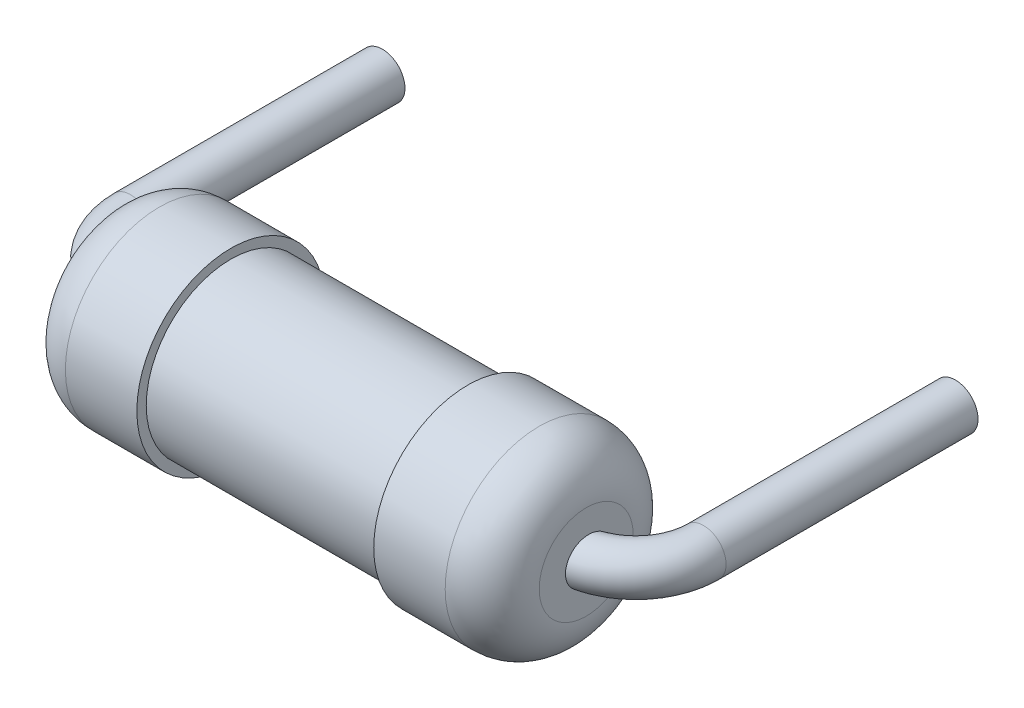
ISO-10303-21;
HEADER;
FILE_DESCRIPTION(('STEP AP214'),'2;1');
FILE_NAME('part.step','',(''),(''),'','','');
FILE_SCHEMA(('AUTOMOTIVE_DESIGN { 1 0 10303 214 1 1 1 1 }'));
ENDSEC;
DATA;
#1=APPLICATION_CONTEXT('core data for automotive mechanical design processes');
#2=APPLICATION_PROTOCOL_DEFINITION('international standard','automotive_design',2000,#1);
#3=PRODUCT_CONTEXT('',#1,'mechanical');
#4=PRODUCT('Part','Part','',(#3));
#5=PRODUCT_RELATED_PRODUCT_CATEGORY('part','',(#4));
#6=PRODUCT_DEFINITION_FORMATION('','',#4);
#7=PRODUCT_DEFINITION_CONTEXT('part definition',#1,'design');
#8=PRODUCT_DEFINITION('design','',#6,#7);
#9=PRODUCT_DEFINITION_SHAPE('','',#8);
#10=(LENGTH_UNIT() NAMED_UNIT(*) SI_UNIT(.MILLI.,.METRE.));
#11=(NAMED_UNIT(*) PLANE_ANGLE_UNIT() SI_UNIT($,.RADIAN.));
#12=(NAMED_UNIT(*) SI_UNIT($,.STERADIAN.) SOLID_ANGLE_UNIT());
#13=UNCERTAINTY_MEASURE_WITH_UNIT(LENGTH_MEASURE(1.E-05),#10,'distance_accuracy_value','');
#14=(GEOMETRIC_REPRESENTATION_CONTEXT(3) GLOBAL_UNCERTAINTY_ASSIGNED_CONTEXT((#13)) GLOBAL_UNIT_ASSIGNED_CONTEXT((#10,
#11,#12)) REPRESENTATION_CONTEXT('',''));
#15=CARTESIAN_POINT('',(0.,0.,0.));
#16=DIRECTION('',(0.,0.,1.));
#17=DIRECTION('',(1.,0.,0.));
#18=AXIS2_PLACEMENT_3D('',#15,#16,#17);
#19=CARTESIAN_POINT('',(7.32,-0.30606,-3.));
#20=DIRECTION('',(0.,0.,1.));
#21=DIRECTION('',(1.,0.,0.));
#22=AXIS2_PLACEMENT_3D('',#19,#20,#21);
#23=PLANE('',#22);
#24=CARTESIAN_POINT('',(7.61999999999981,0.,-3.));
#25=DIRECTION('',(0.,0.,-1.));
#26=DIRECTION('',(-1.,0.,0.));
#27=AXIS2_PLACEMENT_3D('',#24,#25,#26);
#28=CIRCLE('',#27,0.29999999999984);
#29=CARTESIAN_POINT('',(7.31999999999997,0.,-3.));
#30=VERTEX_POINT('',#29);
#31=EDGE_CURVE('E19',#30,#30,#28,.F.);
#32=ORIENTED_EDGE('',*,*,#31,.F.);
#33=EDGE_LOOP('',(#32));
#34=FACE_BOUND('',#33,.T.);
#35=ADVANCED_FACE('F15',(#34),#23,.F.);
#36=CARTESIAN_POINT('',(0.3,-0.30606,-3.));
#37=DIRECTION('',(0.,0.,-1.));
#38=DIRECTION('',(-1.,0.,0.));
#39=AXIS2_PLACEMENT_3D('',#36,#37,#38);
#40=PLANE('',#39);
#41=CARTESIAN_POINT('',(1.94411002053807E-13,0.,-3.));
#42=DIRECTION('',(0.,0.,1.));
#43=DIRECTION('',(1.,0.,0.));
#44=AXIS2_PLACEMENT_3D('',#41,#42,#43);
#45=CIRCLE('',#44,0.29999999999984);
#46=CARTESIAN_POINT('',(0.300000000000034,0.,-3.));
#47=VERTEX_POINT('',#46);
#48=EDGE_CURVE('E108',#47,#47,#45,.T.);
#49=ORIENTED_EDGE('',*,*,#48,.F.);
#50=EDGE_LOOP('',(#49));
#51=FACE_BOUND('',#50,.T.);
#52=ADVANCED_FACE('F121',(#51),#40,.T.);
#53=CARTESIAN_POINT('',(7.61999999999981,0.,0.35));
#54=DIRECTION('',(0.,0.,-1.));
#55=DIRECTION('',(-1.,0.,0.));
#56=AXIS2_PLACEMENT_3D('',#53,#54,#55);
#57=CYLINDRICAL_SURFACE('',#56,0.29999999999984);
#58=ORIENTED_EDGE('',*,*,#31,.T.);
#59=EDGE_LOOP('',(#58));
#60=FACE_BOUND('',#59,.T.);
#61=CARTESIAN_POINT('',(7.61999999999981,0.,0.35));
#62=DIRECTION('',(0.,0.,1.));
#63=DIRECTION('',(1.,0.,0.));
#64=AXIS2_PLACEMENT_3D('',#61,#62,#63);
#65=CIRCLE('',#64,0.29999999999984);
#66=CARTESIAN_POINT('',(7.91999999999965,0.,0.35));
#67=VERTEX_POINT('',#66);
#68=EDGE_CURVE('E31',#67,#67,#65,.T.);
#69=ORIENTED_EDGE('',*,*,#68,.F.);
#70=EDGE_LOOP('',(#69));
#71=FACE_BOUND('',#70,.T.);
#72=ADVANCED_FACE('F117',(#60,#71),#57,.T.);
#73=CARTESIAN_POINT('',(1.94411002053807E-13,0.,-3.));
#74=DIRECTION('',(0.,0.,1.));
#75=DIRECTION('',(1.,0.,0.));
#76=AXIS2_PLACEMENT_3D('',#73,#74,#75);
#77=CYLINDRICAL_SURFACE('',#76,0.29999999999984);
#78=CARTESIAN_POINT('',(1.94749815232709E-13,0.,0.35));
#79=DIRECTION('',(0.,0.,1.));
#80=DIRECTION('',(1.,0.,0.));
#81=AXIS2_PLACEMENT_3D('',#78,#79,#80);
#82=CIRCLE('',#81,0.29999999999984);
#83=CARTESIAN_POINT('',(0.300000000000035,0.,0.35));
#84=VERTEX_POINT('',#83);
#85=EDGE_CURVE('E102',#84,#84,#82,.T.);
#86=ORIENTED_EDGE('',*,*,#85,.F.);
#87=EDGE_LOOP('',(#86));
#88=FACE_BOUND('',#87,.T.);
#89=ORIENTED_EDGE('',*,*,#48,.T.);
#90=EDGE_LOOP('',(#89));
#91=FACE_BOUND('',#90,.T.);
#92=ADVANCED_FACE('F131',(#88,#91),#77,.T.);
#93=CARTESIAN_POINT('',(6.71999999999944,0.,0.35));
#94=DIRECTION('',(0.,1.,0.));
#95=DIRECTION('',(-1.,0.,0.));
#96=AXIS2_PLACEMENT_3D('',#93,#94,#95);
#97=TOROIDAL_SURFACE('',#96,0.899999999999278,0.299999999999489);
#98=ORIENTED_EDGE('',*,*,#68,.T.);
#99=EDGE_LOOP('',(#98));
#100=FACE_BOUND('',#99,.T.);
#101=CARTESIAN_POINT('',(6.96,0.,0.899909083394227));
#102=CARTESIAN_POINT('',(6.96,0.0159516554723529,0.899910187994072));
#103=CARTESIAN_POINT('',(6.96,0.0319162433137313,0.901305025316858));
#104=CARTESIAN_POINT('',(6.96,0.0633800309051226,0.906818061157604));
#105=CARTESIAN_POINT('',(6.96,0.0788785689724196,0.910939956734047));
#106=CARTESIAN_POINT('',(6.96,0.108924283208002,0.921697106341317));
#107=CARTESIAN_POINT('',(6.96,0.123474005167887,0.928325280422508));
#108=CARTESIAN_POINT('',(6.96,0.151316689300573,0.943824914688805));
#109=CARTESIAN_POINT('',(6.96,0.164609686434443,0.952696312443997));
#110=CARTESIAN_POINT('',(6.96,0.190219770658707,0.97281979688568));
#111=CARTESIAN_POINT('',(6.96,0.202467582678886,0.984159904646155));
#112=CARTESIAN_POINT('',(6.96,0.225042694189264,1.00861260964609));
#113=CARTESIAN_POINT('',(6.96,0.235369406577394,1.02172574662893));
#114=CARTESIAN_POINT('',(6.96,0.254552398792096,1.05035890713556));
#115=CARTESIAN_POINT('',(6.96,0.263252705808074,1.06598362592229));
#116=CARTESIAN_POINT('',(6.96,0.278005987297219,1.09843802639794));
#117=CARTESIAN_POINT('',(6.96,0.284058377101174,1.1152679732517));
#118=CARTESIAN_POINT('',(6.96,0.293506458879565,1.15025944165083));
#119=CARTESIAN_POINT('',(6.96,0.296807665208281,1.16844659340842));
#120=CARTESIAN_POINT('',(6.96,0.300288414073635,1.20511863148377));
#121=CARTESIAN_POINT('',(6.96,0.300467973664391,1.22360351617441));
#122=CARTESIAN_POINT('',(6.96,0.297667687344931,1.26020668826948));
#123=CARTESIAN_POINT('',(6.96,0.294709573725768,1.27832662303737));
#124=CARTESIAN_POINT('',(6.96,0.285705916224718,1.31378382692248));
#125=CARTESIAN_POINT('',(6.96,0.279660785552893,1.33112120045082));
#126=CARTESIAN_POINT('',(6.96,0.264826971263629,1.36400855368817));
#127=CARTESIAN_POINT('',(6.96,0.256118109397808,1.37959452169983));
#128=CARTESIAN_POINT('',(6.96,0.236129979694342,1.40902140844184));
#129=CARTESIAN_POINT('',(6.96,0.224851149510255,1.42286262367277));
#130=CARTESIAN_POINT('',(6.96,0.200412641652212,1.4479656297997));
#131=CARTESIAN_POINT('',(6.96,0.187319858756497,1.4592925637346));
#132=CARTESIAN_POINT('',(6.96,0.15937935766893,1.47952319329792));
#133=CARTESIAN_POINT('',(6.96,0.144531888275154,1.48842723188031));
#134=CARTESIAN_POINT('',(6.96,0.113885508480636,1.5033439537386));
#135=CARTESIAN_POINT('',(6.96,0.0981175227796086,1.50942021432755));
#136=CARTESIAN_POINT('',(6.96,0.0657767467826424,1.51879640869829));
#137=CARTESIAN_POINT('',(6.96,0.0492040305821791,1.52209659757581));
#138=CARTESIAN_POINT('',(6.96,0.015975533111098,1.52578945049875));
#139=CARTESIAN_POINT('',(6.96,-0.000675770528493447,1.52622251376765));
#140=CARTESIAN_POINT('',(6.96,-0.033812587271213,1.52427514851076));
#141=CARTESIAN_POINT('',(6.96,-0.0502981067358851,1.52189482836002));
#142=CARTESIAN_POINT('',(6.96,-0.0825717167367025,1.51440924014528));
#143=CARTESIAN_POINT('',(6.96,-0.0983622123450345,1.509314327195));
#144=CARTESIAN_POINT('',(6.96,-0.128871428211063,1.49656226495408));
#145=CARTESIAN_POINT('',(6.96,-0.143590135056714,1.48890508360668));
#146=CARTESIAN_POINT('',(6.96,-0.171645704350544,1.47120182502332));
#147=CARTESIAN_POINT('',(6.96,-0.184973007162798,1.46114060785044));
#148=CARTESIAN_POINT('',(6.96,-0.209782585733969,1.4389563050096));
#149=CARTESIAN_POINT('',(6.96,-0.22126474786377,1.42683309245253));
#150=CARTESIAN_POINT('',(6.96,-0.24226456417895,1.40066414391784));
#151=CARTESIAN_POINT('',(6.96,-0.251747233086753,1.38659034859798));
#152=CARTESIAN_POINT('',(6.96,-0.268280580829753,1.35708145376115));
#153=CARTESIAN_POINT('',(6.96,-0.27533100633324,1.34164621265213));
#154=CARTESIAN_POINT('',(6.96,-0.286991318768197,1.30944690478343));
#155=CARTESIAN_POINT('',(6.96,-0.291536427035224,1.29265939320476));
#156=CARTESIAN_POINT('',(6.96,-0.297832779661441,1.25856909134966));
#157=CARTESIAN_POINT('',(6.96,-0.299583605268522,1.24126622423759));
#158=CARTESIAN_POINT('',(6.96,-0.300294916790561,1.20608766031497));
#159=CARTESIAN_POINT('',(6.96,-0.299170757013623,1.18821024912771));
#160=CARTESIAN_POINT('',(6.96,-0.294017455863944,1.15287882084873));
#161=CARTESIAN_POINT('',(6.96,-0.289987841262898,1.13542487320772));
#162=CARTESIAN_POINT('',(6.96,-0.279006983383342,1.10095788229671));
#163=CARTESIAN_POINT('',(6.96,-0.271982337972454,1.08396818292799));
#164=CARTESIAN_POINT('',(6.96,-0.255194862822717,1.0513965631107));
#165=CARTESIAN_POINT('',(6.96,-0.24543169022594,1.0358148192584));
#166=CARTESIAN_POINT('',(6.96,-0.223359370560577,1.00646253700531));
#167=CARTESIAN_POINT('',(6.96,-0.211039462629748,0.992700069911511));
#168=CARTESIAN_POINT('',(6.96,-0.184175106224645,0.967534850720645));
#169=CARTESIAN_POINT('',(6.96,-0.169630418876712,0.956132352322167));
#170=CARTESIAN_POINT('',(6.96,-0.139312830790398,0.936553425045167));
#171=CARTESIAN_POINT('',(6.96,-0.12361036634622,0.92826811449565));
#172=CARTESIAN_POINT('',(6.96,-0.0909712953937541,0.914716960454299));
#173=CARTESIAN_POINT('',(6.96,-0.0740373949840587,0.909444709015332));
#174=CARTESIAN_POINT('',(6.96,-0.0474451129434389,0.903859690620982));
#175=CARTESIAN_POINT('',(6.96,-0.0380186040920175,0.902381231314353));
#176=CARTESIAN_POINT('',(6.96,-0.0190629345979922,0.900405612394796));
#177=CARTESIAN_POINT('',(6.96,-0.00953377705739398,0.899908423211422));
#178=CARTESIAN_POINT('',(6.96,0.,0.899909083394227));
#179=B_SPLINE_CURVE_WITH_KNOTS('',3,(#101,#102,#103,#104,#105,#106,#107,#108,#109,#110,#111,
#112,#113,#114,#115,#116,#117,#118,#119,#120,#121,#122,#123,#124,#125,#126,#127,#128,#129,#130,
#131,#132,#133,#134,#135,#136,#137,#138,#139,#140,#141,#142,#143,#144,#145,#146,#147,#148,#149,
#150,#151,#152,#153,#154,#155,#156,#157,#158,#159,#160,#161,#162,#163,#164,#165,#166,#167,#168,
#169,#170,#171,#172,#173,#174,#175,#176,#177,#178),.UNSPECIFIED.,.T.,.F.,(4,2,2,2,2,2,2,2,2,2,2,
2,2,2,2,2,2,2,2,2,2,2,2,2,2,2,2,2,2,2,2,2,2,2,2,2,2,2,4),(0.,0.0478179344156202,
0.0957008285544918,0.143449457463582,0.191196757653313,0.241058262822145,0.290934981087823,
0.34434470711367,0.397766220245816,0.452954550652603,0.508142579555495,0.562950843485259,
0.617751773023366,0.671049197498355,0.724337552446225,0.776020626233687,0.827696380618804,
0.878146299893447,0.92859158277282,0.978324525451834,1.02805555241804,1.0775982189962,
1.12714150543005,1.17700543033234,1.22687242482395,1.27755039821194,1.32823364840088,
1.3801723356866,1.4321188057903,1.48561218181605,1.53911427258742,1.59401064945776,
1.64891390231076,1.70405309850704,1.75919821913741,1.81218303933785,1.86505475201696,
1.89363481165573,1.92221401002506),.UNSPECIFIED.);
#180=CARTESIAN_POINT('',(6.96,0.,0.899909083394227));
#181=VERTEX_POINT('',#180);
#182=EDGE_CURVE('E54',#181,#181,#179,.T.);
#183=ORIENTED_EDGE('',*,*,#182,.T.);
#184=EDGE_LOOP('',(#183));
#185=FACE_BOUND('',#184,.T.);
#186=ADVANCED_FACE('F133',(#100,#185),#97,.T.);
#187=CARTESIAN_POINT('',(0.899999999999423,0.,0.35));
#188=DIRECTION('',(0.,1.,0.));
#189=DIRECTION('',(-1.,0.,0.));
#190=AXIS2_PLACEMENT_3D('',#187,#188,#189);
#191=TOROIDAL_SURFACE('',#190,0.899999999999228,0.29999999999984);
#192=CARTESIAN_POINT('',(0.66,0.,0.899909083394285));
#193=CARTESIAN_POINT('',(0.66,0.0159516554723797,0.89991018799413));
#194=CARTESIAN_POINT('',(0.66,0.0319162433137845,0.901305025316918));
#195=CARTESIAN_POINT('',(0.66,0.0633800309052281,0.906818061157672));
#196=CARTESIAN_POINT('',(0.66,0.078878568972551,0.910939956734121));
#197=CARTESIAN_POINT('',(0.66,0.108924283208184,0.921697106341406));
#198=CARTESIAN_POINT('',(0.66,0.123474005168094,0.928325280422608));
#199=CARTESIAN_POINT('',(0.66,0.151316689300827,0.943824914688929));
#200=CARTESIAN_POINT('',(0.66,0.164609686434719,0.952696312444136));
#201=CARTESIAN_POINT('',(0.66,0.190219770659021,0.972819796885851));
#202=CARTESIAN_POINT('',(0.66,0.202467582679216,0.984159904646342));
#203=CARTESIAN_POINT('',(0.66,0.22504269418962,1.00861260964631));
#204=CARTESIAN_POINT('',(0.66,0.235369406577761,1.02172574662917));
#205=CARTESIAN_POINT('',(0.66,0.254552398792476,1.05035890713584));
#206=CARTESIAN_POINT('',(0.66,0.263252705808456,1.06598362592258));
#207=CARTESIAN_POINT('',(0.66,0.278005987297602,1.09843802639826));
#208=CARTESIAN_POINT('',(0.66,0.284058377101556,1.11526797325204));
#209=CARTESIAN_POINT('',(0.66,0.293506458879939,1.15025944165119));
#210=CARTESIAN_POINT('',(0.66,0.29680766520865,1.16844659340879));
#211=CARTESIAN_POINT('',(0.66,0.300288414073991,1.20511863148415));
#212=CARTESIAN_POINT('',(0.66,0.300467973664741,1.2236035161748));
#213=CARTESIAN_POINT('',(0.66,0.297667687345266,1.26020668826988));
#214=CARTESIAN_POINT('',(0.66,0.294709573726096,1.27832662303778));
#215=CARTESIAN_POINT('',(0.66,0.285705916225031,1.3137838269229));
#216=CARTESIAN_POINT('',(0.66,0.279660785553198,1.33112120045123));
#217=CARTESIAN_POINT('',(0.66,0.264826971263918,1.3640085536886));
#218=CARTESIAN_POINT('',(0.66,0.256118109398088,1.37959452170027));
#219=CARTESIAN_POINT('',(0.66,0.236129979694602,1.40902140844229));
#220=CARTESIAN_POINT('',(0.66,0.224851149510505,1.42286262367323));
#221=CARTESIAN_POINT('',(0.66,0.20041264165244,1.44796562980017));
#222=CARTESIAN_POINT('',(0.66,0.187319858756711,1.45929256373508));
#223=CARTESIAN_POINT('',(0.66,0.159379357669116,1.47952319329841));
#224=CARTESIAN_POINT('',(0.66,0.144531888275325,1.48842723188081));
#225=CARTESIAN_POINT('',(0.66,0.113885508480773,1.50334395373912));
#226=CARTESIAN_POINT('',(0.66,0.0981175227797272,1.50942021432807));
#227=CARTESIAN_POINT('',(0.66,0.0657767467827223,1.51879640869882));
#228=CARTESIAN_POINT('',(0.66,0.0492040305822393,1.52209659757635));
#229=CARTESIAN_POINT('',(0.66,0.0159755331111163,1.52578945049929));
#230=CARTESIAN_POINT('',(0.66,-0.000675770528497326,1.52622251376819));
#231=CARTESIAN_POINT('',(0.66,-0.0338125872712611,1.52427514851129));
#232=CARTESIAN_POINT('',(0.66,-0.0502981067359551,1.52189482836055));
#233=CARTESIAN_POINT('',(0.66,-0.0825717167368162,1.51440924014581));
#234=CARTESIAN_POINT('',(0.66,-0.0983622123451699,1.50931432719552));
#235=CARTESIAN_POINT('',(0.66,-0.12887142821124,1.49656226495458));
#236=CARTESIAN_POINT('',(0.66,-0.143590135056912,1.48890508360717));
#237=CARTESIAN_POINT('',(0.66,-0.171645704350778,1.47120182502378));
#238=CARTESIAN_POINT('',(0.66,-0.18497300716305,1.46114060785089));
#239=CARTESIAN_POINT('',(0.66,-0.209782585734252,1.43895630501002));
#240=CARTESIAN_POINT('',(0.66,-0.221264747864068,1.42683309245294));
#241=CARTESIAN_POINT('',(0.66,-0.24226456417927,1.40066414391821));
#242=CARTESIAN_POINT('',(0.66,-0.251747233087083,1.38659034859833));
#243=CARTESIAN_POINT('',(0.66,-0.268280580830099,1.35708145376147));
#244=CARTESIAN_POINT('',(0.66,-0.275331006333592,1.34164621265242));
#245=CARTESIAN_POINT('',(0.66,-0.286991318768556,1.3094469047837));
#246=CARTESIAN_POINT('',(0.66,-0.291536427035584,1.29265939320501));
#247=CARTESIAN_POINT('',(0.66,-0.2978327796618,1.25856909134987));
#248=CARTESIAN_POINT('',(0.66,-0.299583605268879,1.24126622423779));
#249=CARTESIAN_POINT('',(0.66,-0.300294916790909,1.20608766031514));
#250=CARTESIAN_POINT('',(0.66,-0.299170757013966,1.18821024912787));
#251=CARTESIAN_POINT('',(0.66,-0.294017455864272,1.15287882084887));
#252=CARTESIAN_POINT('',(0.66,-0.289987841263219,1.13542487320784));
#253=CARTESIAN_POINT('',(0.66,-0.279006983383646,1.10095788229682));
#254=CARTESIAN_POINT('',(0.66,-0.271982337972749,1.0839681829281));
#255=CARTESIAN_POINT('',(0.66,-0.255194862822994,1.0513965631108));
#256=CARTESIAN_POINT('',(0.66,-0.245431690226208,1.03581481925851));
#257=CARTESIAN_POINT('',(0.66,-0.223359370560826,1.0064625370054));
#258=CARTESIAN_POINT('',(0.66,-0.211039462629988,0.992700069911609));
#259=CARTESIAN_POINT('',(0.66,-0.184175106224868,0.967534850720742));
#260=CARTESIAN_POINT('',(0.66,-0.169630418876927,0.956132352322264));
#261=CARTESIAN_POINT('',(0.66,-0.139312830790593,0.936553425045259));
#262=CARTESIAN_POINT('',(0.66,-0.123610366346402,0.928268114495739));
#263=CARTESIAN_POINT('',(0.66,-0.0909712953939107,0.914716960454381));
#264=CARTESIAN_POINT('',(0.66,-0.0740373949842029,0.90944470901541));
#265=CARTESIAN_POINT('',(0.66,-0.0474451129435491,0.903859690621051));
#266=CARTESIAN_POINT('',(0.66,-0.0380186040921058,0.902381231314418));
#267=CARTESIAN_POINT('',(0.66,-0.0190629345980363,0.900405612394855));
#268=CARTESIAN_POINT('',(0.66,-0.00953377705741589,0.899908423211479));
#269=CARTESIAN_POINT('',(0.66,0.,0.899909083394285));
#270=B_SPLINE_CURVE_WITH_KNOTS('',3,(#192,#193,#194,#195,#196,#197,#198,#199,#200,#201,#202,
#203,#204,#205,#206,#207,#208,#209,#210,#211,#212,#213,#214,#215,#216,#217,#218,#219,#220,#221,
#222,#223,#224,#225,#226,#227,#228,#229,#230,#231,#232,#233,#234,#235,#236,#237,#238,#239,#240,
#241,#242,#243,#244,#245,#246,#247,#248,#249,#250,#251,#252,#253,#254,#255,#256,#257,#258,#259,
#260,#261,#262,#263,#264,#265,#266,#267,#268,#269),.UNSPECIFIED.,.T.,.F.,(4,2,2,2,2,2,2,2,2,2,2,
2,2,2,2,2,2,2,2,2,2,2,2,2,2,2,2,2,2,2,2,2,2,2,2,2,2,2,4),(0.,0.0478179344156994,
0.0957008285546502,0.14344945746382,0.191196757653631,0.241058262822529,0.290934981088275,
0.34434470711416,0.397766220246346,0.452954550653153,0.508142579556064,0.562950843485848,
0.617751773023976,0.671049197498998,0.724337552446901,0.776020626234411,0.827696380619577,
0.878146299894279,0.928591582773711,0.978324525452792,1.02805555241906,1.0775982189973,
1.12714150543121,1.17700543033356,1.22687242482524,1.27755039821329,1.32823364840229,
1.38017233568806,1.4321188057918,1.48561218181759,1.53911427258899,1.59401064945936,
1.64891390231238,1.70405309850867,1.75919821913907,1.81218303933954,1.86505475201869,
1.89363481165752,1.92221401002692),.UNSPECIFIED.);
#271=CARTESIAN_POINT('',(0.66,0.,0.899909083394285));
#272=VERTEX_POINT('',#271);
#273=EDGE_CURVE('E47',#272,#272,#270,.T.);
#274=ORIENTED_EDGE('',*,*,#273,.F.);
#275=EDGE_LOOP('',(#274));
#276=FACE_BOUND('',#275,.T.);
#277=ORIENTED_EDGE('',*,*,#85,.T.);
#278=EDGE_LOOP('',(#277));
#279=FACE_BOUND('',#278,.T.);
#280=ADVANCED_FACE('F59',(#276,#279),#191,.T.);
#281=CARTESIAN_POINT('',(6.96,0.625,1.8875));
#282=DIRECTION('',(-1.,0.,0.));
#283=DIRECTION('',(0.,0.,-1.));
#284=AXIS2_PLACEMENT_3D('',#281,#282,#283);
#285=PLANE('',#284);
#286=ORIENTED_EDGE('',*,*,#182,.F.);
#287=EDGE_LOOP('',(#286));
#288=FACE_BOUND('',#287,.T.);
#289=CARTESIAN_POINT('',(6.96000000000002,0.,1.25));
#290=DIRECTION('',(1.,0.,0.));
#291=DIRECTION('',(0.,0.,-1.));
#292=AXIS2_PLACEMENT_3D('',#289,#290,#291);
#293=CIRCLE('',#292,0.625000000000056);
#294=CARTESIAN_POINT('',(6.96000000000002,0.,0.624999999999944));
#295=VERTEX_POINT('',#294);
#296=EDGE_CURVE('E44',#295,#295,#293,.F.);
#297=ORIENTED_EDGE('',*,*,#296,.F.);
#298=EDGE_LOOP('',(#297));
#299=FACE_BOUND('',#298,.T.);
#300=ADVANCED_FACE('F66',(#288,#299),#285,.F.);
#301=CARTESIAN_POINT('',(0.66,0.625,1.8875));
#302=DIRECTION('',(-1.,0.,0.));
#303=DIRECTION('',(0.,0.,-1.));
#304=AXIS2_PLACEMENT_3D('',#301,#302,#303);
#305=PLANE('',#304);
#306=ORIENTED_EDGE('',*,*,#273,.T.);
#307=EDGE_LOOP('',(#306));
#308=FACE_BOUND('',#307,.T.);
#309=CARTESIAN_POINT('',(0.659999999999977,0.,1.25));
#310=DIRECTION('',(-1.,0.,0.));
#311=DIRECTION('',(0.,0.,1.));
#312=AXIS2_PLACEMENT_3D('',#309,#310,#311);
#313=CIRCLE('',#312,0.625000000000056);
#314=CARTESIAN_POINT('',(0.659999999999977,0.,1.87500000000006));
#315=VERTEX_POINT('',#314);
#316=EDGE_CURVE('E40',#315,#315,#313,.F.);
#317=ORIENTED_EDGE('',*,*,#316,.F.);
#318=EDGE_LOOP('',(#317));
#319=FACE_BOUND('',#318,.T.);
#320=ADVANCED_FACE('F61',(#308,#319),#305,.T.);
#321=CARTESIAN_POINT('',(6.335,0.,1.25));
#322=DIRECTION('',(1.,0.,0.));
#323=DIRECTION('',(0.,0.,-1.));
#324=AXIS2_PLACEMENT_3D('',#321,#322,#323);
#325=TOROIDAL_SURFACE('',#324,0.625000000000056,0.625000000000023);
#326=CARTESIAN_POINT('',(6.335,0.,1.25));
#327=DIRECTION('',(-1.,0.,0.));
#328=DIRECTION('',(0.,0.,1.));
#329=AXIS2_PLACEMENT_3D('',#326,#327,#328);
#330=CIRCLE('',#329,1.25000000000018);
#331=CARTESIAN_POINT('',(6.335,0.,2.50000000000018));
#332=VERTEX_POINT('',#331);
#333=EDGE_CURVE('E43',#332,#332,#330,.T.);
#334=ORIENTED_EDGE('',*,*,#333,.F.);
#335=EDGE_LOOP('',(#334));
#336=FACE_BOUND('',#335,.T.);
#337=ORIENTED_EDGE('',*,*,#296,.T.);
#338=EDGE_LOOP('',(#337));
#339=FACE_BOUND('',#338,.T.);
#340=ADVANCED_FACE('F65',(#336,#339),#325,.T.);
#341=CARTESIAN_POINT('',(1.285,0.,1.25));
#342=DIRECTION('',(-1.,0.,0.));
#343=DIRECTION('',(0.,0.,1.));
#344=AXIS2_PLACEMENT_3D('',#341,#342,#343);
#345=TOROIDAL_SURFACE('',#344,0.625000000000056,0.625000000000023);
#346=CARTESIAN_POINT('',(1.285,0.,1.25));
#347=DIRECTION('',(1.,0.,0.));
#348=DIRECTION('',(0.,0.,-1.));
#349=AXIS2_PLACEMENT_3D('',#346,#347,#348);
#350=CIRCLE('',#349,1.25000000000018);
#351=CARTESIAN_POINT('',(1.285,0.,-1.8323016715005E-13));
#352=VERTEX_POINT('',#351);
#353=EDGE_CURVE('E39',#352,#352,#350,.T.);
#354=ORIENTED_EDGE('',*,*,#353,.F.);
#355=EDGE_LOOP('',(#354));
#356=FACE_BOUND('',#355,.T.);
#357=ORIENTED_EDGE('',*,*,#316,.T.);
#358=EDGE_LOOP('',(#357));
#359=FACE_BOUND('',#358,.T.);
#360=ADVANCED_FACE('F71',(#356,#359),#345,.T.);
#361=CARTESIAN_POINT('',(6.335,0.,1.25));
#362=DIRECTION('',(-1.,0.,0.));
#363=DIRECTION('',(0.,0.,1.));
#364=AXIS2_PLACEMENT_3D('',#361,#362,#363);
#365=CYLINDRICAL_SURFACE('',#364,1.25000000000018);
#366=ORIENTED_EDGE('',*,*,#333,.T.);
#367=EDGE_LOOP('',(#366));
#368=FACE_BOUND('',#367,.T.);
#369=CARTESIAN_POINT('',(5.385,0.,1.25));
#370=DIRECTION('',(-1.,0.,0.));
#371=DIRECTION('',(0.,0.,1.));
#372=AXIS2_PLACEMENT_3D('',#369,#370,#371);
#373=CIRCLE('',#372,1.25000000000018);
#374=CARTESIAN_POINT('',(5.385,0.,2.50000000000018));
#375=VERTEX_POINT('',#374);
#376=EDGE_CURVE('E36',#375,#375,#373,.T.);
#377=ORIENTED_EDGE('',*,*,#376,.F.);
#378=EDGE_LOOP('',(#377));
#379=FACE_BOUND('',#378,.T.);
#380=ADVANCED_FACE('F75',(#368,#379),#365,.T.);
#381=CARTESIAN_POINT('',(2.235,0.,1.25));
#382=DIRECTION('',(-1.,0.,0.));
#383=DIRECTION('',(0.,0.,1.));
#384=AXIS2_PLACEMENT_3D('',#381,#382,#383);
#385=CYLINDRICAL_SURFACE('',#384,1.25000000000018);
#386=CARTESIAN_POINT('',(2.235,0.,1.25));
#387=DIRECTION('',(-1.,0.,0.));
#388=DIRECTION('',(0.,0.,1.));
#389=AXIS2_PLACEMENT_3D('',#386,#387,#388);
#390=CIRCLE('',#389,1.25000000000018);
#391=CARTESIAN_POINT('',(2.235,0.,2.50000000000018));
#392=VERTEX_POINT('',#391);
#393=EDGE_CURVE('E28',#392,#392,#390,.T.);
#394=ORIENTED_EDGE('',*,*,#393,.T.);
#395=EDGE_LOOP('',(#394));
#396=FACE_BOUND('',#395,.T.);
#397=ORIENTED_EDGE('',*,*,#353,.T.);
#398=EDGE_LOOP('',(#397));
#399=FACE_BOUND('',#398,.T.);
#400=ADVANCED_FACE('F79',(#396,#399),#385,.T.);
#401=CARTESIAN_POINT('',(5.385,1.25,2.525));
#402=DIRECTION('',(-1.,0.,0.));
#403=DIRECTION('',(0.,0.,-1.));
#404=AXIS2_PLACEMENT_3D('',#401,#402,#403);
#405=PLANE('',#404);
#406=CARTESIAN_POINT('',(5.385,0.,1.25));
#407=DIRECTION('',(-1.,0.,0.));
#408=DIRECTION('',(0.,0.,1.));
#409=AXIS2_PLACEMENT_3D('',#406,#407,#408);
#410=CIRCLE('',#409,1.12499999999981);
#411=CARTESIAN_POINT('',(5.385,0.,2.37499999999981));
#412=VERTEX_POINT('',#411);
#413=EDGE_CURVE('E23',#412,#412,#410,.T.);
#414=ORIENTED_EDGE('',*,*,#413,.F.);
#415=EDGE_LOOP('',(#414));
#416=FACE_BOUND('',#415,.T.);
#417=ORIENTED_EDGE('',*,*,#376,.T.);
#418=EDGE_LOOP('',(#417));
#419=FACE_BOUND('',#418,.T.);
#420=ADVANCED_FACE('F83',(#416,#419),#405,.T.);
#421=CARTESIAN_POINT('',(2.235,1.25,2.525));
#422=DIRECTION('',(-1.,0.,0.));
#423=DIRECTION('',(0.,0.,-1.));
#424=AXIS2_PLACEMENT_3D('',#421,#422,#423);
#425=PLANE('',#424);
#426=CARTESIAN_POINT('',(2.235,0.,1.25));
#427=DIRECTION('',(-1.,0.,0.));
#428=DIRECTION('',(0.,0.,1.));
#429=AXIS2_PLACEMENT_3D('',#426,#427,#428);
#430=CIRCLE('',#429,1.12499999999981);
#431=CARTESIAN_POINT('',(2.235,0.,2.37499999999981));
#432=VERTEX_POINT('',#431);
#433=EDGE_CURVE('E10',#432,#432,#430,.F.);
#434=ORIENTED_EDGE('',*,*,#433,.F.);
#435=EDGE_LOOP('',(#434));
#436=FACE_BOUND('',#435,.T.);
#437=ORIENTED_EDGE('',*,*,#393,.F.);
#438=EDGE_LOOP('',(#437));
#439=FACE_BOUND('',#438,.T.);
#440=ADVANCED_FACE('F86',(#436,#439),#425,.F.);
#441=CARTESIAN_POINT('',(5.385,0.,1.25));
#442=DIRECTION('',(-1.,0.,0.));
#443=DIRECTION('',(0.,0.,1.));
#444=AXIS2_PLACEMENT_3D('',#441,#442,#443);
#445=CYLINDRICAL_SURFACE('',#444,1.12499999999981);
#446=ORIENTED_EDGE('',*,*,#433,.T.);
#447=EDGE_LOOP('',(#446));
#448=FACE_BOUND('',#447,.T.);
#449=ORIENTED_EDGE('',*,*,#413,.T.);
#450=EDGE_LOOP('',(#449));
#451=FACE_BOUND('',#450,.T.);
#452=ADVANCED_FACE('F17',(#448,#451),#445,.T.);
#453=CLOSED_SHELL('',(#35,#52,#72,#92,#186,#280,#300,#320,#340,#360,#380,#400,#420,#440,#452));
#454=MANIFOLD_SOLID_BREP('B1',#453);
#455=ADVANCED_BREP_SHAPE_REPRESENTATION('',(#18,#454),#14);
#456=SHAPE_DEFINITION_REPRESENTATION(#9,#455);
ENDSEC;
END-ISO-10303-21;
